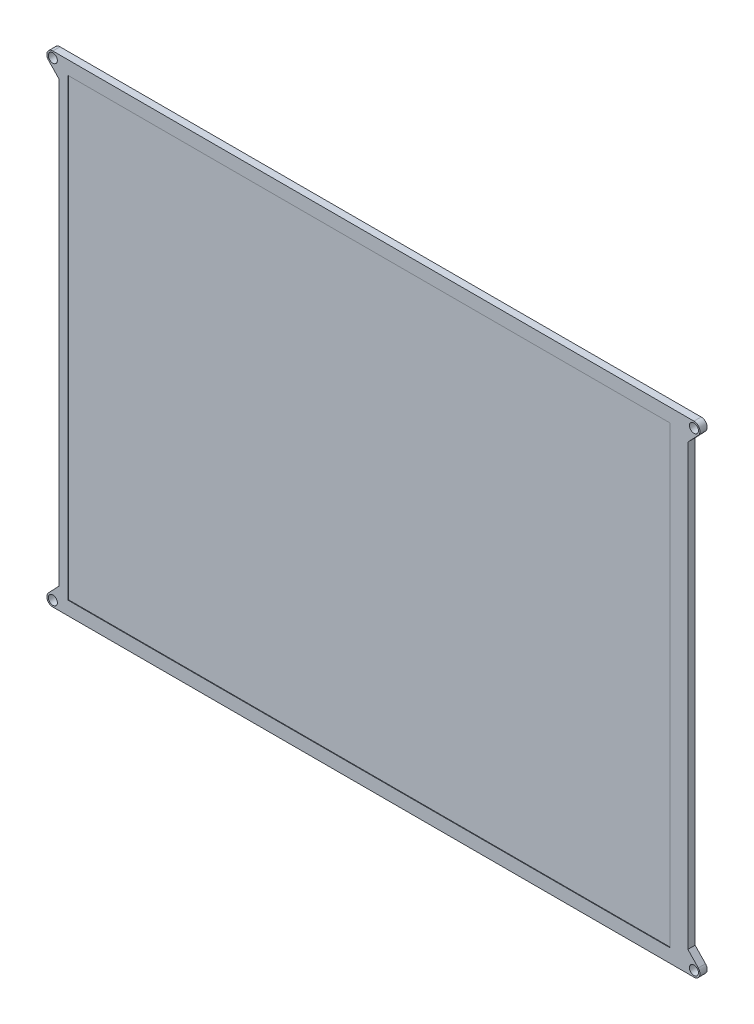
ISO-10303-21;
HEADER;
FILE_DESCRIPTION(('STEP AP214'),'2;1');
FILE_NAME('part.step','',(''),(''),'','','');
FILE_SCHEMA(('AUTOMOTIVE_DESIGN { 1 0 10303 214 1 1 1 1 }'));
ENDSEC;
DATA;
#1=APPLICATION_CONTEXT('core data for automotive mechanical design processes');
#2=APPLICATION_PROTOCOL_DEFINITION('international standard','automotive_design',2000,#1);
#3=PRODUCT_CONTEXT('',#1,'mechanical');
#4=PRODUCT('Part','Part','',(#3));
#5=PRODUCT_RELATED_PRODUCT_CATEGORY('part','',(#4));
#6=PRODUCT_DEFINITION_FORMATION('','',#4);
#7=PRODUCT_DEFINITION_CONTEXT('part definition',#1,'design');
#8=PRODUCT_DEFINITION('design','',#6,#7);
#9=PRODUCT_DEFINITION_SHAPE('','',#8);
#10=(LENGTH_UNIT() NAMED_UNIT(*) SI_UNIT(.MILLI.,.METRE.));
#11=(NAMED_UNIT(*) PLANE_ANGLE_UNIT() SI_UNIT($,.RADIAN.));
#12=(NAMED_UNIT(*) SI_UNIT($,.STERADIAN.) SOLID_ANGLE_UNIT());
#13=UNCERTAINTY_MEASURE_WITH_UNIT(LENGTH_MEASURE(1.E-05),#10,'distance_accuracy_value','');
#14=(GEOMETRIC_REPRESENTATION_CONTEXT(3) GLOBAL_UNCERTAINTY_ASSIGNED_CONTEXT((#13)) GLOBAL_UNIT_ASSIGNED_CONTEXT((#10,
#11,#12)) REPRESENTATION_CONTEXT('',''));
#15=CARTESIAN_POINT('',(0.,0.,0.));
#16=DIRECTION('',(0.,0.,1.));
#17=DIRECTION('',(1.,0.,0.));
#18=AXIS2_PLACEMENT_3D('',#15,#16,#17);
#19=CARTESIAN_POINT('',(104.5,0.,2.4));
#20=DIRECTION('',(1.,0.,0.));
#21=DIRECTION('',(0.,0.,-1.));
#22=AXIS2_PLACEMENT_3D('',#19,#20,#21);
#23=PLANE('',#22);
#24=DIRECTION('',(0.,-1.,0.));
#25=VECTOR('',#24,1.);
#26=CARTESIAN_POINT('',(104.5,0.,0.));
#27=LINE('',#26,#25);
#28=CARTESIAN_POINT('',(104.5,73.0000000000001,0.));
#29=VERTEX_POINT('',#28);
#30=CARTESIAN_POINT('',(104.5,-73.0000000000001,0.));
#31=VERTEX_POINT('',#30);
#32=EDGE_CURVE('E178',#29,#31,#27,.T.);
#33=ORIENTED_EDGE('',*,*,#32,.F.);
#34=DIRECTION('',(0.,0.,-1.));
#35=VECTOR('',#34,1.);
#36=CARTESIAN_POINT('',(104.5,73.0000000000001,2.4));
#37=LINE('',#36,#35);
#38=CARTESIAN_POINT('',(104.5,73.0000000000001,2.4));
#39=VERTEX_POINT('',#38);
#40=EDGE_CURVE('E11',#39,#29,#37,.T.);
#41=ORIENTED_EDGE('',*,*,#40,.F.);
#42=DIRECTION('',(0.,-1.,0.));
#43=VECTOR('',#42,1.);
#44=CARTESIAN_POINT('',(104.5,0.,2.4));
#45=LINE('',#44,#43);
#46=CARTESIAN_POINT('',(104.5,-73.0000000000001,2.4));
#47=VERTEX_POINT('',#46);
#48=EDGE_CURVE('E219',#39,#47,#45,.T.);
#49=ORIENTED_EDGE('',*,*,#48,.T.);
#50=DIRECTION('',(0.,0.,-1.));
#51=VECTOR('',#50,1.);
#52=CARTESIAN_POINT('',(104.5,-73.0000000000001,2.4));
#53=LINE('',#52,#51);
#54=EDGE_CURVE('E57',#47,#31,#53,.T.);
#55=ORIENTED_EDGE('',*,*,#54,.T.);
#56=EDGE_LOOP('',(#33,#41,#49,#55));
#57=FACE_BOUND('',#56,.T.);
#58=ADVANCED_FACE('F34',(#57),#23,.T.);
#59=CARTESIAN_POINT('',(18.3406658739592,-17.4673008323422,2.4));
#60=DIRECTION('',(-0.724137931034481,0.689655172413795,0.));
#61=DIRECTION('',(-0.689655172413795,-0.724137931034481,0.));
#62=AXIS2_PLACEMENT_3D('',#59,#60,#61);
#63=PLANE('',#62);
#64=DIRECTION('',(0.689655172413795,0.724137931034481,0.));
#65=VECTOR('',#64,1.);
#66=CARTESIAN_POINT('',(18.3406658739592,-17.4673008323422,0.));
#67=LINE('',#66,#65);
#68=CARTESIAN_POINT('',(107.948275862069,76.6206896551725,0.));
#69=VERTEX_POINT('',#68);
#70=EDGE_CURVE('E180',#29,#69,#67,.T.);
#71=ORIENTED_EDGE('',*,*,#70,.T.);
#72=DIRECTION('',(0.,0.,-1.));
#73=VECTOR('',#72,1.);
#74=CARTESIAN_POINT('',(107.948275862069,76.6206896551725,2.4));
#75=LINE('',#74,#73);
#76=CARTESIAN_POINT('',(107.948275862069,76.6206896551725,2.4));
#77=VERTEX_POINT('',#76);
#78=EDGE_CURVE('E41',#77,#69,#75,.T.);
#79=ORIENTED_EDGE('',*,*,#78,.F.);
#80=DIRECTION('',(0.689655172413795,0.724137931034481,0.));
#81=VECTOR('',#80,1.);
#82=CARTESIAN_POINT('',(18.3406658739592,-17.4673008323422,2.4));
#83=LINE('',#82,#81);
#84=EDGE_CURVE('E262',#39,#77,#83,.T.);
#85=ORIENTED_EDGE('',*,*,#84,.F.);
#86=ORIENTED_EDGE('',*,*,#40,.T.);
#87=EDGE_LOOP('',(#71,#79,#85,#86));
#88=FACE_BOUND('',#87,.T.);
#89=ADVANCED_FACE('F355',(#88),#63,.F.);
#90=CARTESIAN_POINT('',(106.5,78.,2.4));
#91=DIRECTION('',(0.,0.,-1.));
#92=DIRECTION('',(-1.,0.,0.));
#93=AXIS2_PLACEMENT_3D('',#90,#91,#92);
#94=CYLINDRICAL_SURFACE('',#93,1.99999999999998);
#95=CARTESIAN_POINT('',(106.5,78.,0.));
#96=DIRECTION('',(0.,0.,1.));
#97=DIRECTION('',(1.,0.,0.));
#98=AXIS2_PLACEMENT_3D('',#95,#96,#97);
#99=CIRCLE('',#98,1.99999999999998);
#100=CARTESIAN_POINT('',(106.5,80.,0.));
#101=VERTEX_POINT('',#100);
#102=EDGE_CURVE('E183',#69,#101,#99,.T.);
#103=ORIENTED_EDGE('',*,*,#102,.T.);
#104=DIRECTION('',(0.,0.,-1.));
#105=VECTOR('',#104,1.);
#106=CARTESIAN_POINT('',(106.5,80.,2.4));
#107=LINE('',#106,#105);
#108=CARTESIAN_POINT('',(106.5,80.,2.4));
#109=VERTEX_POINT('',#108);
#110=EDGE_CURVE('E235',#109,#101,#107,.T.);
#111=ORIENTED_EDGE('',*,*,#110,.F.);
#112=CARTESIAN_POINT('',(106.5,78.,2.4));
#113=DIRECTION('',(0.,0.,1.));
#114=DIRECTION('',(1.,0.,0.));
#115=AXIS2_PLACEMENT_3D('',#112,#113,#114);
#116=CIRCLE('',#115,1.99999999999998);
#117=EDGE_CURVE('E243',#77,#109,#116,.T.);
#118=ORIENTED_EDGE('',*,*,#117,.F.);
#119=ORIENTED_EDGE('',*,*,#78,.T.);
#120=EDGE_LOOP('',(#103,#111,#118,#119));
#121=FACE_BOUND('',#120,.T.);
#122=ADVANCED_FACE('F241',(#121),#94,.T.);
#123=CARTESIAN_POINT('',(0.,80.,2.4));
#124=DIRECTION('',(0.,1.,0.));
#125=DIRECTION('',(0.,0.,1.));
#126=AXIS2_PLACEMENT_3D('',#123,#124,#125);
#127=PLANE('',#126);
#128=DIRECTION('',(1.,0.,0.));
#129=VECTOR('',#128,1.);
#130=CARTESIAN_POINT('',(0.,80.,0.));
#131=LINE('',#130,#129);
#132=CARTESIAN_POINT('',(-106.5,79.9999999999985,0.));
#133=VERTEX_POINT('',#132);
#134=EDGE_CURVE('E186',#133,#101,#131,.T.);
#135=ORIENTED_EDGE('',*,*,#134,.F.);
#136=DIRECTION('',(0.,0.,-1.));
#137=VECTOR('',#136,1.);
#138=CARTESIAN_POINT('',(-106.5,79.9999999999985,2.4));
#139=LINE('',#138,#137);
#140=CARTESIAN_POINT('',(-106.5,79.9999999999985,2.4));
#141=VERTEX_POINT('',#140);
#142=EDGE_CURVE('E233',#141,#133,#139,.T.);
#143=ORIENTED_EDGE('',*,*,#142,.F.);
#144=DIRECTION('',(1.,0.,0.));
#145=VECTOR('',#144,1.);
#146=CARTESIAN_POINT('',(0.,80.,2.4));
#147=LINE('',#146,#145);
#148=EDGE_CURVE('E255',#141,#109,#147,.T.);
#149=ORIENTED_EDGE('',*,*,#148,.T.);
#150=ORIENTED_EDGE('',*,*,#110,.T.);
#151=EDGE_LOOP('',(#135,#143,#149,#150));
#152=FACE_BOUND('',#151,.T.);
#153=ADVANCED_FACE('F252',(#152),#127,.T.);
#154=CARTESIAN_POINT('',(-106.5,78.,2.4));
#155=DIRECTION('',(0.,0.,-1.));
#156=DIRECTION('',(-1.,0.,0.));
#157=AXIS2_PLACEMENT_3D('',#154,#155,#156);
#158=CYLINDRICAL_SURFACE('',#157,1.99999999999975);
#159=CARTESIAN_POINT('',(-106.5,78.,0.));
#160=DIRECTION('',(0.,0.,1.));
#161=DIRECTION('',(1.,0.,0.));
#162=AXIS2_PLACEMENT_3D('',#159,#160,#161);
#163=CIRCLE('',#162,1.99999999999975);
#164=CARTESIAN_POINT('',(-107.948275862069,76.6206896551709,0.));
#165=VERTEX_POINT('',#164);
#166=EDGE_CURVE('E189',#165,#133,#163,.F.);
#167=ORIENTED_EDGE('',*,*,#166,.F.);
#168=DIRECTION('',(0.,0.,-1.));
#169=VECTOR('',#168,1.);
#170=CARTESIAN_POINT('',(-107.948275862069,76.6206896551709,2.4));
#171=LINE('',#170,#169);
#172=CARTESIAN_POINT('',(-107.948275862069,76.6206896551709,2.4));
#173=VERTEX_POINT('',#172);
#174=EDGE_CURVE('E231',#173,#165,#171,.T.);
#175=ORIENTED_EDGE('',*,*,#174,.F.);
#176=CARTESIAN_POINT('',(-106.5,78.,2.4));
#177=DIRECTION('',(0.,0.,1.));
#178=DIRECTION('',(1.,0.,0.));
#179=AXIS2_PLACEMENT_3D('',#176,#177,#178);
#180=CIRCLE('',#179,1.99999999999975);
#181=EDGE_CURVE('E258',#173,#141,#180,.F.);
#182=ORIENTED_EDGE('',*,*,#181,.T.);
#183=ORIENTED_EDGE('',*,*,#142,.T.);
#184=EDGE_LOOP('',(#167,#175,#182,#183));
#185=FACE_BOUND('',#184,.T.);
#186=ADVANCED_FACE('F366',(#185),#158,.T.);
#187=CARTESIAN_POINT('',(-18.3406658739582,-17.4673008323418,2.4));
#188=DIRECTION('',(-0.72413793103447,-0.689655172413807,0.));
#189=DIRECTION('',(0.689655172413807,-0.72413793103447,0.));
#190=AXIS2_PLACEMENT_3D('',#187,#188,#189);
#191=PLANE('',#190);
#192=DIRECTION('',(-0.689655172413807,0.72413793103447,0.));
#193=VECTOR('',#192,1.);
#194=CARTESIAN_POINT('',(-18.3406658739582,-17.4673008323418,0.));
#195=LINE('',#194,#193);
#196=CARTESIAN_POINT('',(-104.5,72.9999999999987,0.));
#197=VERTEX_POINT('',#196);
#198=EDGE_CURVE('E192',#197,#165,#195,.T.);
#199=ORIENTED_EDGE('',*,*,#198,.F.);
#200=DIRECTION('',(0.,0.,-1.));
#201=VECTOR('',#200,1.);
#202=CARTESIAN_POINT('',(-104.5,72.9999999999987,2.4));
#203=LINE('',#202,#201);
#204=CARTESIAN_POINT('',(-104.5,72.9999999999987,2.4));
#205=VERTEX_POINT('',#204);
#206=EDGE_CURVE('E229',#205,#197,#203,.T.);
#207=ORIENTED_EDGE('',*,*,#206,.F.);
#208=DIRECTION('',(-0.689655172413807,0.72413793103447,0.));
#209=VECTOR('',#208,1.);
#210=CARTESIAN_POINT('',(-18.3406658739582,-17.4673008323418,2.4));
#211=LINE('',#210,#209);
#212=EDGE_CURVE('E260',#205,#173,#211,.T.);
#213=ORIENTED_EDGE('',*,*,#212,.T.);
#214=ORIENTED_EDGE('',*,*,#174,.T.);
#215=EDGE_LOOP('',(#199,#207,#213,#214));
#216=FACE_BOUND('',#215,.T.);
#217=ADVANCED_FACE('F369',(#216),#191,.T.);
#218=CARTESIAN_POINT('',(-104.5,0.,2.4));
#219=DIRECTION('',(1.,0.,0.));
#220=DIRECTION('',(0.,1.,0.));
#221=AXIS2_PLACEMENT_3D('',#218,#219,#220);
#222=PLANE('',#221);
#223=DIRECTION('',(0.,-1.,0.));
#224=VECTOR('',#223,1.);
#225=CARTESIAN_POINT('',(-104.5,0.,0.));
#226=LINE('',#225,#224);
#227=CARTESIAN_POINT('',(-104.5,-72.9999999999986,0.));
#228=VERTEX_POINT('',#227);
#229=EDGE_CURVE('E195',#197,#228,#226,.T.);
#230=ORIENTED_EDGE('',*,*,#229,.T.);
#231=DIRECTION('',(0.,0.,-1.));
#232=VECTOR('',#231,1.);
#233=CARTESIAN_POINT('',(-104.5,-72.9999999999986,2.4));
#234=LINE('',#233,#232);
#235=CARTESIAN_POINT('',(-104.5,-72.9999999999986,2.4));
#236=VERTEX_POINT('',#235);
#237=EDGE_CURVE('E226',#236,#228,#234,.T.);
#238=ORIENTED_EDGE('',*,*,#237,.F.);
#239=DIRECTION('',(0.,-1.,0.));
#240=VECTOR('',#239,1.);
#241=CARTESIAN_POINT('',(-104.5,0.,2.4));
#242=LINE('',#241,#240);
#243=EDGE_CURVE('E268',#205,#236,#242,.T.);
#244=ORIENTED_EDGE('',*,*,#243,.F.);
#245=ORIENTED_EDGE('',*,*,#206,.T.);
#246=EDGE_LOOP('',(#230,#238,#244,#245));
#247=FACE_BOUND('',#246,.T.);
#248=ADVANCED_FACE('F373',(#247),#222,.F.);
#249=CARTESIAN_POINT('',(-18.3406658739582,17.4673008323418,2.4));
#250=DIRECTION('',(0.72413793103447,-0.689655172413807,0.));
#251=DIRECTION('',(0.689655172413807,0.72413793103447,0.));
#252=AXIS2_PLACEMENT_3D('',#249,#250,#251);
#253=PLANE('',#252);
#254=DIRECTION('',(-0.689655172413807,-0.72413793103447,0.));
#255=VECTOR('',#254,1.);
#256=CARTESIAN_POINT('',(-18.3406658739582,17.4673008323418,0.));
#257=LINE('',#256,#255);
#258=CARTESIAN_POINT('',(-107.948275862069,-76.6206896551709,0.));
#259=VERTEX_POINT('',#258);
#260=EDGE_CURVE('E197',#228,#259,#257,.T.);
#261=ORIENTED_EDGE('',*,*,#260,.T.);
#262=DIRECTION('',(0.,0.,-1.));
#263=VECTOR('',#262,1.);
#264=CARTESIAN_POINT('',(-107.948275862069,-76.6206896551709,2.4));
#265=LINE('',#264,#263);
#266=CARTESIAN_POINT('',(-107.948275862069,-76.6206896551709,2.4));
#267=VERTEX_POINT('',#266);
#268=EDGE_CURVE('E223',#267,#259,#265,.T.);
#269=ORIENTED_EDGE('',*,*,#268,.F.);
#270=DIRECTION('',(-0.689655172413807,-0.72413793103447,0.));
#271=VECTOR('',#270,1.);
#272=CARTESIAN_POINT('',(-18.3406658739582,17.4673008323418,2.4));
#273=LINE('',#272,#271);
#274=EDGE_CURVE('E270',#236,#267,#273,.T.);
#275=ORIENTED_EDGE('',*,*,#274,.F.);
#276=ORIENTED_EDGE('',*,*,#237,.T.);
#277=EDGE_LOOP('',(#261,#269,#275,#276));
#278=FACE_BOUND('',#277,.T.);
#279=ADVANCED_FACE('F277',(#278),#253,.F.);
#280=CARTESIAN_POINT('',(-106.5,-78.,2.4));
#281=DIRECTION('',(0.,0.,-1.));
#282=DIRECTION('',(-1.,0.,0.));
#283=AXIS2_PLACEMENT_3D('',#280,#281,#282);
#284=CYLINDRICAL_SURFACE('',#283,1.99999999999975);
#285=CARTESIAN_POINT('',(-106.5,-78.,0.));
#286=DIRECTION('',(0.,0.,1.));
#287=DIRECTION('',(1.,0.,0.));
#288=AXIS2_PLACEMENT_3D('',#285,#286,#287);
#289=CIRCLE('',#288,1.99999999999975);
#290=CARTESIAN_POINT('',(-106.5,-79.9999999999985,0.));
#291=VERTEX_POINT('',#290);
#292=EDGE_CURVE('E199',#259,#291,#289,.T.);
#293=ORIENTED_EDGE('',*,*,#292,.T.);
#294=DIRECTION('',(0.,0.,-1.));
#295=VECTOR('',#294,1.);
#296=CARTESIAN_POINT('',(-106.5,-79.9999999999985,2.4));
#297=LINE('',#296,#295);
#298=CARTESIAN_POINT('',(-106.5,-79.9999999999985,2.4));
#299=VERTEX_POINT('',#298);
#300=EDGE_CURVE('E157',#299,#291,#297,.T.);
#301=ORIENTED_EDGE('',*,*,#300,.F.);
#302=CARTESIAN_POINT('',(-106.5,-78.,2.4));
#303=DIRECTION('',(0.,0.,1.));
#304=DIRECTION('',(1.,0.,0.));
#305=AXIS2_PLACEMENT_3D('',#302,#303,#304);
#306=CIRCLE('',#305,1.99999999999975);
#307=EDGE_CURVE('E144',#267,#299,#306,.T.);
#308=ORIENTED_EDGE('',*,*,#307,.F.);
#309=ORIENTED_EDGE('',*,*,#268,.T.);
#310=EDGE_LOOP('',(#293,#301,#308,#309));
#311=FACE_BOUND('',#310,.T.);
#312=ADVANCED_FACE('F281',(#311),#284,.T.);
#313=CARTESIAN_POINT('',(0.,-80.,2.4));
#314=DIRECTION('',(0.,1.,0.));
#315=DIRECTION('',(0.,0.,1.));
#316=AXIS2_PLACEMENT_3D('',#313,#314,#315);
#317=PLANE('',#316);
#318=DIRECTION('',(1.,0.,0.));
#319=VECTOR('',#318,1.);
#320=CARTESIAN_POINT('',(0.,-80.,0.));
#321=LINE('',#320,#319);
#322=CARTESIAN_POINT('',(106.5,-80.,0.));
#323=VERTEX_POINT('',#322);
#324=EDGE_CURVE('E153',#291,#323,#321,.T.);
#325=ORIENTED_EDGE('',*,*,#324,.T.);
#326=DIRECTION('',(0.,0.,-1.));
#327=VECTOR('',#326,1.);
#328=CARTESIAN_POINT('',(106.5,-80.,2.4));
#329=LINE('',#328,#327);
#330=CARTESIAN_POINT('',(106.5,-80.,2.4));
#331=VERTEX_POINT('',#330);
#332=EDGE_CURVE('E150',#331,#323,#329,.T.);
#333=ORIENTED_EDGE('',*,*,#332,.F.);
#334=DIRECTION('',(1.,0.,0.));
#335=VECTOR('',#334,1.);
#336=CARTESIAN_POINT('',(0.,-80.,2.4));
#337=LINE('',#336,#335);
#338=EDGE_CURVE('E135',#299,#331,#337,.T.);
#339=ORIENTED_EDGE('',*,*,#338,.F.);
#340=ORIENTED_EDGE('',*,*,#300,.T.);
#341=EDGE_LOOP('',(#325,#333,#339,#340));
#342=FACE_BOUND('',#341,.T.);
#343=ADVANCED_FACE('F151',(#342),#317,.F.);
#344=CARTESIAN_POINT('',(106.5,-78.,2.4));
#345=DIRECTION('',(0.,0.,-1.));
#346=DIRECTION('',(-1.,0.,0.));
#347=AXIS2_PLACEMENT_3D('',#344,#345,#346);
#348=CYLINDRICAL_SURFACE('',#347,1.99999999999998);
#349=CARTESIAN_POINT('',(106.5,-78.,0.));
#350=DIRECTION('',(0.,0.,1.));
#351=DIRECTION('',(1.,0.,0.));
#352=AXIS2_PLACEMENT_3D('',#349,#350,#351);
#353=CIRCLE('',#352,1.99999999999998);
#354=CARTESIAN_POINT('',(107.948275862069,-76.6206896551725,0.));
#355=VERTEX_POINT('',#354);
#356=EDGE_CURVE('E202',#355,#323,#353,.F.);
#357=ORIENTED_EDGE('',*,*,#356,.F.);
#358=DIRECTION('',(0.,0.,-1.));
#359=VECTOR('',#358,1.);
#360=CARTESIAN_POINT('',(107.948275862069,-76.6206896551725,2.4));
#361=LINE('',#360,#359);
#362=CARTESIAN_POINT('',(107.948275862069,-76.6206896551725,2.4));
#363=VERTEX_POINT('',#362);
#364=EDGE_CURVE('E158',#363,#355,#361,.T.);
#365=ORIENTED_EDGE('',*,*,#364,.F.);
#366=CARTESIAN_POINT('',(106.5,-78.,2.4));
#367=DIRECTION('',(0.,0.,1.));
#368=DIRECTION('',(1.,0.,0.));
#369=AXIS2_PLACEMENT_3D('',#366,#367,#368);
#370=CIRCLE('',#369,1.99999999999998);
#371=EDGE_CURVE('E142',#363,#331,#370,.F.);
#372=ORIENTED_EDGE('',*,*,#371,.T.);
#373=ORIENTED_EDGE('',*,*,#332,.T.);
#374=EDGE_LOOP('',(#357,#365,#372,#373));
#375=FACE_BOUND('',#374,.T.);
#376=ADVANCED_FACE('F160',(#375),#348,.T.);
#377=CARTESIAN_POINT('',(106.5,-78.,2.4));
#378=DIRECTION('',(0.,0.,-1.));
#379=DIRECTION('',(-1.,0.,0.));
#380=AXIS2_PLACEMENT_3D('',#377,#378,#379);
#381=CYLINDRICAL_SURFACE('',#380,1.5);
#382=CARTESIAN_POINT('',(106.5,-78.,2.4));
#383=DIRECTION('',(0.,0.,1.));
#384=DIRECTION('',(1.,0.,0.));
#385=AXIS2_PLACEMENT_3D('',#382,#383,#384);
#386=CIRCLE('',#385,1.5);
#387=CARTESIAN_POINT('',(108.,-78.,2.4));
#388=VERTEX_POINT('',#387);
#389=EDGE_CURVE('E172',#388,#388,#386,.F.);
#390=ORIENTED_EDGE('',*,*,#389,.F.);
#391=EDGE_LOOP('',(#390));
#392=FACE_BOUND('',#391,.T.);
#393=CARTESIAN_POINT('',(106.5,-78.,0.));
#394=DIRECTION('',(0.,0.,1.));
#395=DIRECTION('',(1.,0.,0.));
#396=AXIS2_PLACEMENT_3D('',#393,#394,#395);
#397=CIRCLE('',#396,1.5);
#398=CARTESIAN_POINT('',(108.,-78.,0.));
#399=VERTEX_POINT('',#398);
#400=EDGE_CURVE('E213',#399,#399,#397,.F.);
#401=ORIENTED_EDGE('',*,*,#400,.T.);
#402=EDGE_LOOP('',(#401));
#403=FACE_BOUND('',#402,.T.);
#404=ADVANCED_FACE('F386',(#392,#403),#381,.F.);
#405=CARTESIAN_POINT('',(-106.5,78.,2.4));
#406=DIRECTION('',(0.,0.,-1.));
#407=DIRECTION('',(-1.,0.,0.));
#408=AXIS2_PLACEMENT_3D('',#405,#406,#407);
#409=CYLINDRICAL_SURFACE('',#408,1.49999999999956);
#410=CARTESIAN_POINT('',(-106.5,78.,2.4));
#411=DIRECTION('',(0.,0.,1.));
#412=DIRECTION('',(1.,0.,0.));
#413=AXIS2_PLACEMENT_3D('',#410,#411,#412);
#414=CIRCLE('',#413,1.49999999999956);
#415=CARTESIAN_POINT('',(-105.,78.,2.4));
#416=VERTEX_POINT('',#415);
#417=EDGE_CURVE('E169',#416,#416,#414,.F.);
#418=ORIENTED_EDGE('',*,*,#417,.F.);
#419=EDGE_LOOP('',(#418));
#420=FACE_BOUND('',#419,.T.);
#421=CARTESIAN_POINT('',(-106.5,78.,0.));
#422=DIRECTION('',(0.,0.,1.));
#423=DIRECTION('',(1.,0.,0.));
#424=AXIS2_PLACEMENT_3D('',#421,#422,#423);
#425=CIRCLE('',#424,1.49999999999956);
#426=CARTESIAN_POINT('',(-105.,78.,0.));
#427=VERTEX_POINT('',#426);
#428=EDGE_CURVE('E210',#427,#427,#425,.F.);
#429=ORIENTED_EDGE('',*,*,#428,.T.);
#430=EDGE_LOOP('',(#429));
#431=FACE_BOUND('',#430,.T.);
#432=ADVANCED_FACE('F393',(#420,#431),#409,.F.);
#433=CARTESIAN_POINT('',(-106.5,-78.,2.4));
#434=DIRECTION('',(0.,0.,-1.));
#435=DIRECTION('',(-1.,0.,0.));
#436=AXIS2_PLACEMENT_3D('',#433,#434,#435);
#437=CYLINDRICAL_SURFACE('',#436,1.49999999999956);
#438=CARTESIAN_POINT('',(-106.5,-78.,2.4));
#439=DIRECTION('',(0.,0.,1.));
#440=DIRECTION('',(1.,0.,0.));
#441=AXIS2_PLACEMENT_3D('',#438,#439,#440);
#442=CIRCLE('',#441,1.49999999999956);
#443=CARTESIAN_POINT('',(-105.,-78.,2.4));
#444=VERTEX_POINT('',#443);
#445=EDGE_CURVE('E163',#444,#444,#442,.T.);
#446=ORIENTED_EDGE('',*,*,#445,.T.);
#447=EDGE_LOOP('',(#446));
#448=FACE_BOUND('',#447,.T.);
#449=CARTESIAN_POINT('',(-106.5,-78.,0.));
#450=DIRECTION('',(0.,0.,1.));
#451=DIRECTION('',(1.,0.,0.));
#452=AXIS2_PLACEMENT_3D('',#449,#450,#451);
#453=CIRCLE('',#452,1.49999999999956);
#454=CARTESIAN_POINT('',(-105.,-78.,0.));
#455=VERTEX_POINT('',#454);
#456=EDGE_CURVE('E207',#455,#455,#453,.T.);
#457=ORIENTED_EDGE('',*,*,#456,.F.);
#458=EDGE_LOOP('',(#457));
#459=FACE_BOUND('',#458,.T.);
#460=ADVANCED_FACE('F390',(#448,#459),#437,.F.);
#461=CARTESIAN_POINT('',(18.3406658739592,17.4673008323422,2.4));
#462=DIRECTION('',(0.724137931034481,0.689655172413795,0.));
#463=DIRECTION('',(-0.689655172413795,0.724137931034481,0.));
#464=AXIS2_PLACEMENT_3D('',#461,#462,#463);
#465=PLANE('',#464);
#466=DIRECTION('',(0.689655172413795,-0.724137931034481,0.));
#467=VECTOR('',#466,1.);
#468=CARTESIAN_POINT('',(18.3406658739592,17.4673008323422,0.));
#469=LINE('',#468,#467);
#470=EDGE_CURVE('E204',#31,#355,#469,.T.);
#471=ORIENTED_EDGE('',*,*,#470,.F.);
#472=ORIENTED_EDGE('',*,*,#54,.F.);
#473=DIRECTION('',(0.689655172413795,-0.724137931034481,0.));
#474=VECTOR('',#473,1.);
#475=CARTESIAN_POINT('',(18.3406658739592,17.4673008323422,2.4));
#476=LINE('',#475,#474);
#477=EDGE_CURVE('E161',#47,#363,#476,.T.);
#478=ORIENTED_EDGE('',*,*,#477,.T.);
#479=ORIENTED_EDGE('',*,*,#364,.T.);
#480=EDGE_LOOP('',(#471,#472,#478,#479));
#481=FACE_BOUND('',#480,.T.);
#482=ADVANCED_FACE('F282',(#481),#465,.T.);
#483=CARTESIAN_POINT('',(106.5,78.,2.4));
#484=DIRECTION('',(0.,0.,-1.));
#485=DIRECTION('',(-1.,0.,0.));
#486=AXIS2_PLACEMENT_3D('',#483,#484,#485);
#487=CYLINDRICAL_SURFACE('',#486,1.5);
#488=CARTESIAN_POINT('',(106.5,78.,2.4));
#489=DIRECTION('',(0.,0.,1.));
#490=DIRECTION('',(1.,0.,0.));
#491=AXIS2_PLACEMENT_3D('',#488,#489,#490);
#492=CIRCLE('',#491,1.5);
#493=CARTESIAN_POINT('',(108.,78.,2.4));
#494=VERTEX_POINT('',#493);
#495=EDGE_CURVE('E175',#494,#494,#492,.T.);
#496=ORIENTED_EDGE('',*,*,#495,.T.);
#497=EDGE_LOOP('',(#496));
#498=FACE_BOUND('',#497,.T.);
#499=CARTESIAN_POINT('',(106.5,78.,0.));
#500=DIRECTION('',(0.,0.,1.));
#501=DIRECTION('',(1.,0.,0.));
#502=AXIS2_PLACEMENT_3D('',#499,#500,#501);
#503=CIRCLE('',#502,1.5);
#504=CARTESIAN_POINT('',(108.,78.,0.));
#505=VERTEX_POINT('',#504);
#506=EDGE_CURVE('E216',#505,#505,#503,.T.);
#507=ORIENTED_EDGE('',*,*,#506,.F.);
#508=EDGE_LOOP('',(#507));
#509=FACE_BOUND('',#508,.T.);
#510=ADVANCED_FACE('F389',(#498,#509),#487,.F.);
#511=CARTESIAN_POINT('',(0.,0.,2.4));
#512=DIRECTION('',(0.,0.,1.));
#513=DIRECTION('',(1.,0.,0.));
#514=AXIS2_PLACEMENT_3D('',#511,#512,#513);
#515=PLANE('',#514);
#516=DIRECTION('',(0.,1.,0.));
#517=VECTOR('',#516,1.);
#518=CARTESIAN_POINT('',(98.4999999999999,75.5,2.4));
#519=LINE('',#518,#517);
#520=CARTESIAN_POINT('',(98.5,-75.5,2.4));
#521=VERTEX_POINT('',#520);
#522=CARTESIAN_POINT('',(98.4999999999999,75.5,2.4));
#523=VERTEX_POINT('',#522);
#524=EDGE_CURVE('E48',#521,#523,#519,.T.);
#525=ORIENTED_EDGE('',*,*,#524,.F.);
#526=DIRECTION('',(1.,0.,0.));
#527=VECTOR('',#526,1.);
#528=CARTESIAN_POINT('',(-101.5,-75.5,2.4));
#529=LINE('',#528,#527);
#530=CARTESIAN_POINT('',(-101.5,-75.5,2.4));
#531=VERTEX_POINT('',#530);
#532=EDGE_CURVE('E295',#531,#521,#529,.T.);
#533=ORIENTED_EDGE('',*,*,#532,.F.);
#534=DIRECTION('',(0.,-1.,0.));
#535=VECTOR('',#534,1.);
#536=CARTESIAN_POINT('',(-101.5,75.5,2.4));
#537=LINE('',#536,#535);
#538=CARTESIAN_POINT('',(-101.5,75.5,2.4));
#539=VERTEX_POINT('',#538);
#540=EDGE_CURVE('E299',#539,#531,#537,.T.);
#541=ORIENTED_EDGE('',*,*,#540,.F.);
#542=DIRECTION('',(-1.,0.,0.));
#543=VECTOR('',#542,1.);
#544=CARTESIAN_POINT('',(-101.5,75.5,2.4));
#545=LINE('',#544,#543);
#546=EDGE_CURVE('E302',#523,#539,#545,.T.);
#547=ORIENTED_EDGE('',*,*,#546,.F.);
#548=EDGE_LOOP('',(#525,#533,#541,#547));
#549=FACE_BOUND('',#548,.T.);
#550=ORIENTED_EDGE('',*,*,#48,.F.);
#551=ORIENTED_EDGE('',*,*,#84,.T.);
#552=ORIENTED_EDGE('',*,*,#117,.T.);
#553=ORIENTED_EDGE('',*,*,#148,.F.);
#554=ORIENTED_EDGE('',*,*,#181,.F.);
#555=ORIENTED_EDGE('',*,*,#212,.F.);
#556=ORIENTED_EDGE('',*,*,#243,.T.);
#557=ORIENTED_EDGE('',*,*,#274,.T.);
#558=ORIENTED_EDGE('',*,*,#307,.T.);
#559=ORIENTED_EDGE('',*,*,#338,.T.);
#560=ORIENTED_EDGE('',*,*,#371,.F.);
#561=ORIENTED_EDGE('',*,*,#477,.F.);
#562=EDGE_LOOP('',(#550,#551,#552,#553,#554,#555,#556,#557,#558,#559,#560,#561));
#563=FACE_BOUND('',#562,.T.);
#564=ORIENTED_EDGE('',*,*,#445,.F.);
#565=EDGE_LOOP('',(#564));
#566=FACE_BOUND('',#565,.T.);
#567=ORIENTED_EDGE('',*,*,#417,.T.);
#568=EDGE_LOOP('',(#567));
#569=FACE_BOUND('',#568,.T.);
#570=ORIENTED_EDGE('',*,*,#389,.T.);
#571=EDGE_LOOP('',(#570));
#572=FACE_BOUND('',#571,.T.);
#573=ORIENTED_EDGE('',*,*,#495,.F.);
#574=EDGE_LOOP('',(#573));
#575=FACE_BOUND('',#574,.T.);
#576=ADVANCED_FACE('F138',(#549,#563,#566,#569,#572,#575),#515,.T.);
#577=CARTESIAN_POINT('',(0.,0.,0.));
#578=DIRECTION('',(0.,0.,1.));
#579=DIRECTION('',(1.,0.,0.));
#580=AXIS2_PLACEMENT_3D('',#577,#578,#579);
#581=PLANE('',#580);
#582=ORIENTED_EDGE('',*,*,#32,.T.);
#583=ORIENTED_EDGE('',*,*,#470,.T.);
#584=ORIENTED_EDGE('',*,*,#356,.T.);
#585=ORIENTED_EDGE('',*,*,#324,.F.);
#586=ORIENTED_EDGE('',*,*,#292,.F.);
#587=ORIENTED_EDGE('',*,*,#260,.F.);
#588=ORIENTED_EDGE('',*,*,#229,.F.);
#589=ORIENTED_EDGE('',*,*,#198,.T.);
#590=ORIENTED_EDGE('',*,*,#166,.T.);
#591=ORIENTED_EDGE('',*,*,#134,.T.);
#592=ORIENTED_EDGE('',*,*,#102,.F.);
#593=ORIENTED_EDGE('',*,*,#70,.F.);
#594=EDGE_LOOP('',(#582,#583,#584,#585,#586,#587,#588,#589,#590,#591,#592,#593));
#595=FACE_BOUND('',#594,.T.);
#596=ORIENTED_EDGE('',*,*,#456,.T.);
#597=EDGE_LOOP('',(#596));
#598=FACE_BOUND('',#597,.T.);
#599=ORIENTED_EDGE('',*,*,#428,.F.);
#600=EDGE_LOOP('',(#599));
#601=FACE_BOUND('',#600,.T.);
#602=ORIENTED_EDGE('',*,*,#400,.F.);
#603=EDGE_LOOP('',(#602));
#604=FACE_BOUND('',#603,.T.);
#605=ORIENTED_EDGE('',*,*,#506,.T.);
#606=EDGE_LOOP('',(#605));
#607=FACE_BOUND('',#606,.T.);
#608=ADVANCED_FACE('F247',(#595,#598,#601,#604,#607),#581,.F.);
#609=CARTESIAN_POINT('',(98.4999999999999,75.5,2.2));
#610=DIRECTION('',(1.,0.,0.));
#611=DIRECTION('',(0.,1.,0.));
#612=AXIS2_PLACEMENT_3D('',#609,#610,#611);
#613=PLANE('',#612);
#614=ORIENTED_EDGE('',*,*,#524,.T.);
#615=DIRECTION('',(0.,0.,1.));
#616=VECTOR('',#615,1.);
#617=CARTESIAN_POINT('',(98.4999999999999,75.5,2.2));
#618=LINE('',#617,#616);
#619=CARTESIAN_POINT('',(98.4999999999999,75.5,2.2));
#620=VERTEX_POINT('',#619);
#621=EDGE_CURVE('E285',#620,#523,#618,.T.);
#622=ORIENTED_EDGE('',*,*,#621,.F.);
#623=DIRECTION('',(0.,1.,0.));
#624=VECTOR('',#623,1.);
#625=CARTESIAN_POINT('',(98.4999999999999,75.5,2.2));
#626=LINE('',#625,#624);
#627=CARTESIAN_POINT('',(98.5,-75.5,2.2));
#628=VERTEX_POINT('',#627);
#629=EDGE_CURVE('E298',#628,#620,#626,.T.);
#630=ORIENTED_EDGE('',*,*,#629,.F.);
#631=DIRECTION('',(0.,0.,1.));
#632=VECTOR('',#631,1.);
#633=CARTESIAN_POINT('',(98.5,-75.5,2.2));
#634=LINE('',#633,#632);
#635=EDGE_CURVE('E181',#628,#521,#634,.T.);
#636=ORIENTED_EDGE('',*,*,#635,.T.);
#637=EDGE_LOOP('',(#614,#622,#630,#636));
#638=FACE_BOUND('',#637,.T.);
#639=ADVANCED_FACE('F323',(#638),#613,.F.);
#640=CARTESIAN_POINT('',(-101.5,-75.5,2.2));
#641=DIRECTION('',(0.,-1.,0.));
#642=DIRECTION('',(0.,0.,-1.));
#643=AXIS2_PLACEMENT_3D('',#640,#641,#642);
#644=PLANE('',#643);
#645=ORIENTED_EDGE('',*,*,#532,.T.);
#646=ORIENTED_EDGE('',*,*,#635,.F.);
#647=DIRECTION('',(1.,0.,0.));
#648=VECTOR('',#647,1.);
#649=CARTESIAN_POINT('',(-101.5,-75.5,2.2));
#650=LINE('',#649,#648);
#651=CARTESIAN_POINT('',(-101.5,-75.5,2.2));
#652=VERTEX_POINT('',#651);
#653=EDGE_CURVE('E288',#652,#628,#650,.T.);
#654=ORIENTED_EDGE('',*,*,#653,.F.);
#655=DIRECTION('',(0.,0.,1.));
#656=VECTOR('',#655,1.);
#657=CARTESIAN_POINT('',(-101.5,-75.5,2.2));
#658=LINE('',#657,#656);
#659=EDGE_CURVE('E291',#652,#531,#658,.T.);
#660=ORIENTED_EDGE('',*,*,#659,.T.);
#661=EDGE_LOOP('',(#645,#646,#654,#660));
#662=FACE_BOUND('',#661,.T.);
#663=ADVANCED_FACE('F334',(#662),#644,.F.);
#664=CARTESIAN_POINT('',(-101.5,75.5,2.2));
#665=DIRECTION('',(-1.,0.,0.));
#666=DIRECTION('',(0.,-1.,0.));
#667=AXIS2_PLACEMENT_3D('',#664,#665,#666);
#668=PLANE('',#667);
#669=ORIENTED_EDGE('',*,*,#540,.T.);
#670=ORIENTED_EDGE('',*,*,#659,.F.);
#671=DIRECTION('',(0.,-1.,0.));
#672=VECTOR('',#671,1.);
#673=CARTESIAN_POINT('',(-101.5,75.5,2.2));
#674=LINE('',#673,#672);
#675=CARTESIAN_POINT('',(-101.5,75.5,2.2));
#676=VERTEX_POINT('',#675);
#677=EDGE_CURVE('E308',#676,#652,#674,.T.);
#678=ORIENTED_EDGE('',*,*,#677,.F.);
#679=DIRECTION('',(0.,0.,1.));
#680=VECTOR('',#679,1.);
#681=CARTESIAN_POINT('',(-101.5,75.5,2.2));
#682=LINE('',#681,#680);
#683=EDGE_CURVE('E287',#676,#539,#682,.T.);
#684=ORIENTED_EDGE('',*,*,#683,.T.);
#685=EDGE_LOOP('',(#669,#670,#678,#684));
#686=FACE_BOUND('',#685,.T.);
#687=ADVANCED_FACE('F339',(#686),#668,.F.);
#688=CARTESIAN_POINT('',(-101.5,75.5,2.2));
#689=DIRECTION('',(0.,1.,0.));
#690=DIRECTION('',(0.,0.,1.));
#691=AXIS2_PLACEMENT_3D('',#688,#689,#690);
#692=PLANE('',#691);
#693=ORIENTED_EDGE('',*,*,#546,.T.);
#694=ORIENTED_EDGE('',*,*,#683,.F.);
#695=DIRECTION('',(-1.,0.,0.));
#696=VECTOR('',#695,1.);
#697=CARTESIAN_POINT('',(-101.5,75.5,2.2));
#698=LINE('',#697,#696);
#699=EDGE_CURVE('E311',#620,#676,#698,.T.);
#700=ORIENTED_EDGE('',*,*,#699,.F.);
#701=ORIENTED_EDGE('',*,*,#621,.T.);
#702=EDGE_LOOP('',(#693,#694,#700,#701));
#703=FACE_BOUND('',#702,.T.);
#704=ADVANCED_FACE('F344',(#703),#692,.F.);
#705=CARTESIAN_POINT('',(0.,0.,2.2));
#706=DIRECTION('',(0.,0.,1.));
#707=DIRECTION('',(1.,0.,0.));
#708=AXIS2_PLACEMENT_3D('',#705,#706,#707);
#709=PLANE('',#708);
#710=ORIENTED_EDGE('',*,*,#629,.T.);
#711=ORIENTED_EDGE('',*,*,#699,.T.);
#712=ORIENTED_EDGE('',*,*,#677,.T.);
#713=ORIENTED_EDGE('',*,*,#653,.T.);
#714=EDGE_LOOP('',(#710,#711,#712,#713));
#715=FACE_BOUND('',#714,.T.);
#716=ADVANCED_FACE('F318',(#715),#709,.T.);
#717=CLOSED_SHELL('',(#58,#89,#122,#153,#186,#217,#248,#279,#312,#343,#376,#404,#432,#460,#482,
#510,#576,#608,#639,#663,#687,#704,#716));
#718=MANIFOLD_SOLID_BREP('B2',#717);
#719=ADVANCED_BREP_SHAPE_REPRESENTATION('',(#18,#718),#14);
#720=SHAPE_DEFINITION_REPRESENTATION(#9,#719);
ENDSEC;
END-ISO-10303-21;
